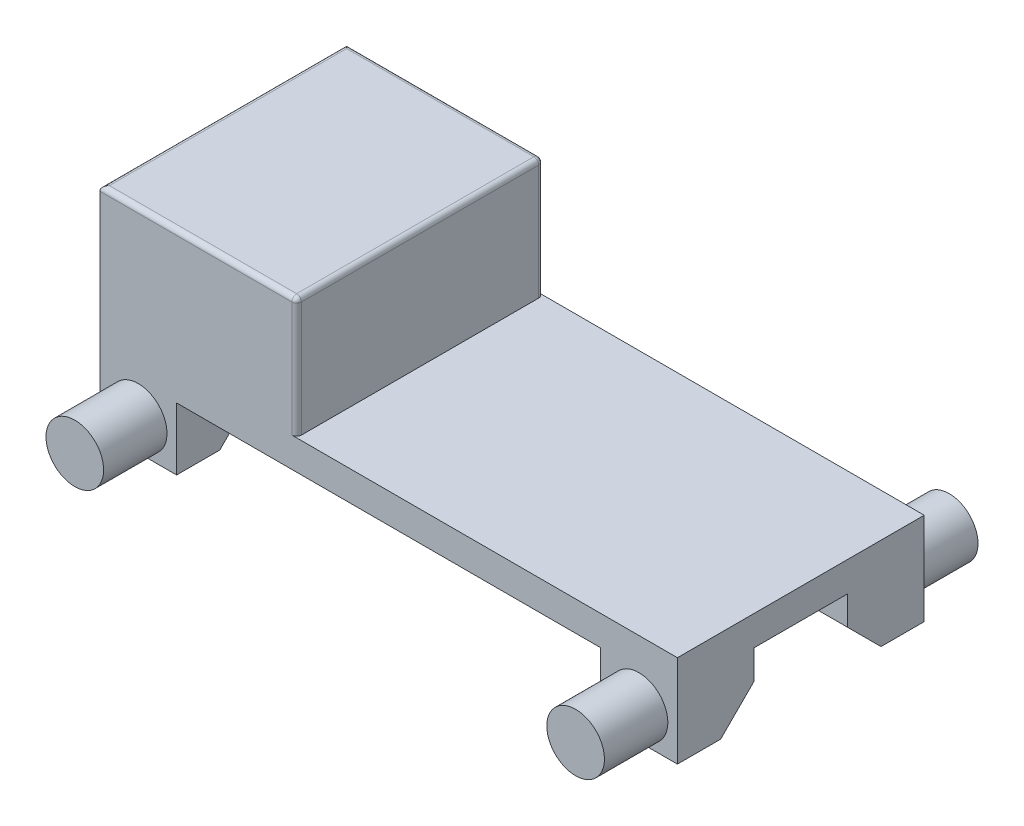
ISO-10303-21;
HEADER;
FILE_DESCRIPTION(('STEP AP214'),'2;1');
FILE_NAME('part.step','',(''),(''),'','','');
FILE_SCHEMA(('AUTOMOTIVE_DESIGN { 1 0 10303 214 1 1 1 1 }'));
ENDSEC;
DATA;
#1=APPLICATION_CONTEXT('core data for automotive mechanical design processes');
#2=APPLICATION_PROTOCOL_DEFINITION('international standard','automotive_design',2000,#1);
#3=PRODUCT_CONTEXT('',#1,'mechanical');
#4=PRODUCT('Part','Part','',(#3));
#5=PRODUCT_RELATED_PRODUCT_CATEGORY('part','',(#4));
#6=PRODUCT_DEFINITION_FORMATION('','',#4);
#7=PRODUCT_DEFINITION_CONTEXT('part definition',#1,'design');
#8=PRODUCT_DEFINITION('design','',#6,#7);
#9=PRODUCT_DEFINITION_SHAPE('','',#8);
#10=(LENGTH_UNIT() NAMED_UNIT(*) SI_UNIT(.MILLI.,.METRE.));
#11=(NAMED_UNIT(*) PLANE_ANGLE_UNIT() SI_UNIT($,.RADIAN.));
#12=(NAMED_UNIT(*) SI_UNIT($,.STERADIAN.) SOLID_ANGLE_UNIT());
#13=UNCERTAINTY_MEASURE_WITH_UNIT(LENGTH_MEASURE(1.E-05),#10,'distance_accuracy_value','');
#14=(GEOMETRIC_REPRESENTATION_CONTEXT(3) GLOBAL_UNCERTAINTY_ASSIGNED_CONTEXT((#13)) GLOBAL_UNIT_ASSIGNED_CONTEXT((#10,
#11,#12)) REPRESENTATION_CONTEXT('',''));
#15=CARTESIAN_POINT('',(0.,0.,0.));
#16=DIRECTION('',(0.,0.,1.));
#17=DIRECTION('',(1.,0.,0.));
#18=AXIS2_PLACEMENT_3D('',#15,#16,#17);
#19=CARTESIAN_POINT('',(0.,0.,0.));
#20=DIRECTION('',(0.,-1.,0.));
#21=DIRECTION('',(0.,0.,-1.));
#22=AXIS2_PLACEMENT_3D('',#19,#20,#21);
#23=PLANE('',#22);
#24=DIRECTION('',(1.,0.,0.));
#25=VECTOR('',#24,1.);
#26=CARTESIAN_POINT('',(601.5,0.,97.0000000000001));
#27=LINE('',#26,#25);
#28=CARTESIAN_POINT('',(441.5,0.,97.0000000000001));
#29=VERTEX_POINT('',#28);
#30=CARTESIAN_POINT('',(601.5,0.,97.0000000000001));
#31=VERTEX_POINT('',#30);
#32=EDGE_CURVE('E225',#29,#31,#27,.T.);
#33=ORIENTED_EDGE('',*,*,#32,.F.);
#34=DIRECTION('',(0.,0.,-1.));
#35=VECTOR('',#34,1.);
#36=CARTESIAN_POINT('',(441.5,0.,257.));
#37=LINE('',#36,#35);
#38=CARTESIAN_POINT('',(441.5,0.,257.));
#39=VERTEX_POINT('',#38);
#40=EDGE_CURVE('E248',#39,#29,#37,.T.);
#41=ORIENTED_EDGE('',*,*,#40,.F.);
#42=DIRECTION('',(1.,0.,0.));
#43=VECTOR('',#42,1.);
#44=CARTESIAN_POINT('',(-601.5,0.,257.));
#45=LINE('',#44,#43);
#46=CARTESIAN_POINT('',(-441.5,0.,257.));
#47=VERTEX_POINT('',#46);
#48=EDGE_CURVE('E327',#47,#39,#45,.T.);
#49=ORIENTED_EDGE('',*,*,#48,.F.);
#50=DIRECTION('',(0.,0.,1.));
#51=VECTOR('',#50,1.);
#52=CARTESIAN_POINT('',(-441.5,0.,257.));
#53=LINE('',#52,#51);
#54=CARTESIAN_POINT('',(-441.5,0.,97.0000000000001));
#55=VERTEX_POINT('',#54);
#56=EDGE_CURVE('E303',#55,#47,#53,.T.);
#57=ORIENTED_EDGE('',*,*,#56,.F.);
#58=DIRECTION('',(1.,0.,0.));
#59=VECTOR('',#58,1.);
#60=CARTESIAN_POINT('',(-601.5,0.,97.0000000000001));
#61=LINE('',#60,#59);
#62=CARTESIAN_POINT('',(-601.5,0.,97.0000000000001));
#63=VERTEX_POINT('',#62);
#64=EDGE_CURVE('E298',#63,#55,#61,.T.);
#65=ORIENTED_EDGE('',*,*,#64,.F.);
#66=DIRECTION('',(0.,0.,1.));
#67=VECTOR('',#66,1.);
#68=CARTESIAN_POINT('',(-601.5,0.,257.));
#69=LINE('',#68,#67);
#70=CARTESIAN_POINT('',(-601.5,0.,-97.0000000000001));
#71=VERTEX_POINT('',#70);
#72=EDGE_CURVE('E334',#71,#63,#69,.T.);
#73=ORIENTED_EDGE('',*,*,#72,.F.);
#74=DIRECTION('',(-1.,0.,0.));
#75=VECTOR('',#74,1.);
#76=CARTESIAN_POINT('',(-601.5,0.,-97.0000000000001));
#77=LINE('',#76,#75);
#78=CARTESIAN_POINT('',(-441.5,0.,-97.0000000000001));
#79=VERTEX_POINT('',#78);
#80=EDGE_CURVE('E282',#79,#71,#77,.T.);
#81=ORIENTED_EDGE('',*,*,#80,.F.);
#82=DIRECTION('',(0.,0.,1.));
#83=VECTOR('',#82,1.);
#84=CARTESIAN_POINT('',(-441.5,0.,-257.));
#85=LINE('',#84,#83);
#86=CARTESIAN_POINT('',(-441.5,0.,-257.));
#87=VERTEX_POINT('',#86);
#88=EDGE_CURVE('E278',#87,#79,#85,.T.);
#89=ORIENTED_EDGE('',*,*,#88,.F.);
#90=DIRECTION('',(-1.,0.,0.));
#91=VECTOR('',#90,1.);
#92=CARTESIAN_POINT('',(-601.5,0.,-257.));
#93=LINE('',#92,#91);
#94=CARTESIAN_POINT('',(441.5,0.,-257.));
#95=VERTEX_POINT('',#94);
#96=EDGE_CURVE('E332',#95,#87,#93,.T.);
#97=ORIENTED_EDGE('',*,*,#96,.F.);
#98=DIRECTION('',(0.,0.,-1.));
#99=VECTOR('',#98,1.);
#100=CARTESIAN_POINT('',(441.5,0.,-257.));
#101=LINE('',#100,#99);
#102=CARTESIAN_POINT('',(441.5,0.,-97.0000000000001));
#103=VERTEX_POINT('',#102);
#104=EDGE_CURVE('E263',#103,#95,#101,.T.);
#105=ORIENTED_EDGE('',*,*,#104,.F.);
#106=DIRECTION('',(-1.,0.,0.));
#107=VECTOR('',#106,1.);
#108=CARTESIAN_POINT('',(601.5,0.,-97.0000000000001));
#109=LINE('',#108,#107);
#110=CARTESIAN_POINT('',(601.5,0.,-97.0000000000001));
#111=VERTEX_POINT('',#110);
#112=EDGE_CURVE('E258',#111,#103,#109,.T.);
#113=ORIENTED_EDGE('',*,*,#112,.F.);
#114=DIRECTION('',(0.,0.,-1.));
#115=VECTOR('',#114,1.);
#116=CARTESIAN_POINT('',(601.5,0.,257.));
#117=LINE('',#116,#115);
#118=EDGE_CURVE('E323',#31,#111,#117,.T.);
#119=ORIENTED_EDGE('',*,*,#118,.F.);
#120=EDGE_LOOP('',(#33,#41,#49,#57,#65,#73,#81,#89,#97,#105,#113,#119));
#121=FACE_BOUND('',#120,.T.);
#122=ADVANCED_FACE('F40',(#121),#23,.T.);
#123=CARTESIAN_POINT('',(0.,62.,0.));
#124=DIRECTION('',(0.,-1.,0.));
#125=DIRECTION('',(0.,0.,-1.));
#126=AXIS2_PLACEMENT_3D('',#123,#124,#125);
#127=PLANE('',#126);
#128=DIRECTION('',(0.,0.,-1.));
#129=VECTOR('',#128,1.);
#130=CARTESIAN_POINT('',(-191.5,62.,-257.));
#131=LINE('',#130,#129);
#132=CARTESIAN_POINT('',(-191.5,62.,247.));
#133=VERTEX_POINT('',#132);
#134=CARTESIAN_POINT('',(-191.5,62.,-247.));
#135=VERTEX_POINT('',#134);
#136=EDGE_CURVE('E320',#133,#135,#131,.T.);
#137=ORIENTED_EDGE('',*,*,#136,.F.);
#138=CARTESIAN_POINT('',(-201.5,62.,247.));
#139=DIRECTION('',(0.,-1.,0.));
#140=DIRECTION('',(0.,0.,-1.));
#141=AXIS2_PLACEMENT_3D('',#138,#139,#140);
#142=CIRCLE('',#141,10.);
#143=CARTESIAN_POINT('',(-201.5,62.,257.));
#144=VERTEX_POINT('',#143);
#145=EDGE_CURVE('E372',#133,#144,#142,.T.);
#146=ORIENTED_EDGE('',*,*,#145,.T.);
#147=DIRECTION('',(1.,0.,0.));
#148=VECTOR('',#147,1.);
#149=CARTESIAN_POINT('',(-601.5,62.,257.));
#150=LINE('',#149,#148);
#151=CARTESIAN_POINT('',(601.5,62.,257.));
#152=VERTEX_POINT('',#151);
#153=EDGE_CURVE('E237',#144,#152,#150,.T.);
#154=ORIENTED_EDGE('',*,*,#153,.T.);
#155=DIRECTION('',(0.,0.,-1.));
#156=VECTOR('',#155,1.);
#157=CARTESIAN_POINT('',(601.5,62.,257.));
#158=LINE('',#157,#156);
#159=CARTESIAN_POINT('',(601.5,62.,-257.));
#160=VERTEX_POINT('',#159);
#161=EDGE_CURVE('E234',#152,#160,#158,.T.);
#162=ORIENTED_EDGE('',*,*,#161,.T.);
#163=DIRECTION('',(-1.,0.,0.));
#164=VECTOR('',#163,1.);
#165=CARTESIAN_POINT('',(-601.5,62.,-257.));
#166=LINE('',#165,#164);
#167=CARTESIAN_POINT('',(-201.5,62.,-257.));
#168=VERTEX_POINT('',#167);
#169=EDGE_CURVE('E326',#160,#168,#166,.T.);
#170=ORIENTED_EDGE('',*,*,#169,.T.);
#171=CARTESIAN_POINT('',(-201.5,62.,-247.));
#172=DIRECTION('',(0.,-1.,0.));
#173=DIRECTION('',(0.,0.,-1.));
#174=AXIS2_PLACEMENT_3D('',#171,#172,#173);
#175=CIRCLE('',#174,10.);
#176=EDGE_CURVE('E370',#168,#135,#175,.T.);
#177=ORIENTED_EDGE('',*,*,#176,.T.);
#178=EDGE_LOOP('',(#137,#146,#154,#162,#170,#177));
#179=FACE_BOUND('',#178,.T.);
#180=ADVANCED_FACE('F452',(#179),#127,.F.);
#181=CARTESIAN_POINT('',(601.5,62.,257.));
#182=DIRECTION('',(-1.,0.,0.));
#183=DIRECTION('',(0.,0.,1.));
#184=AXIS2_PLACEMENT_3D('',#181,#182,#183);
#185=PLANE('',#184);
#186=DIRECTION('',(0.,1.,0.));
#187=VECTOR('',#186,1.);
#188=CARTESIAN_POINT('',(601.5,-130.,-97.0000000000001));
#189=LINE('',#188,#187);
#190=CARTESIAN_POINT('',(601.5,-59.9999999999996,-97.0000000000001));
#191=VERTEX_POINT('',#190);
#192=EDGE_CURVE('E276',#191,#111,#189,.T.);
#193=ORIENTED_EDGE('',*,*,#192,.F.);
#194=DIRECTION('',(0.,0.707106781186549,0.707106781186546));
#195=VECTOR('',#194,1.);
#196=CARTESIAN_POINT('',(601.5,-130.,-167.));
#197=LINE('',#196,#195);
#198=CARTESIAN_POINT('',(601.5,-130.,-167.));
#199=VERTEX_POINT('',#198);
#200=EDGE_CURVE('E423',#191,#199,#197,.F.);
#201=ORIENTED_EDGE('',*,*,#200,.T.);
#202=DIRECTION('',(0.,0.,1.));
#203=VECTOR('',#202,1.);
#204=CARTESIAN_POINT('',(601.5,-130.,-257.));
#205=LINE('',#204,#203);
#206=CARTESIAN_POINT('',(601.5,-130.,-257.));
#207=VERTEX_POINT('',#206);
#208=EDGE_CURVE('E262',#207,#199,#205,.T.);
#209=ORIENTED_EDGE('',*,*,#208,.F.);
#210=DIRECTION('',(0.,-1.,0.));
#211=VECTOR('',#210,1.);
#212=CARTESIAN_POINT('',(601.5,62.,-257.));
#213=LINE('',#212,#211);
#214=EDGE_CURVE('E342',#160,#207,#213,.T.);
#215=ORIENTED_EDGE('',*,*,#214,.F.);
#216=ORIENTED_EDGE('',*,*,#161,.F.);
#217=DIRECTION('',(0.,-1.,0.));
#218=VECTOR('',#217,1.);
#219=CARTESIAN_POINT('',(601.5,62.,257.));
#220=LINE('',#219,#218);
#221=CARTESIAN_POINT('',(601.5,-130.,257.));
#222=VERTEX_POINT('',#221);
#223=EDGE_CURVE('E229',#152,#222,#220,.T.);
#224=ORIENTED_EDGE('',*,*,#223,.T.);
#225=DIRECTION('',(0.,0.,1.));
#226=VECTOR('',#225,1.);
#227=CARTESIAN_POINT('',(601.5,-130.,257.));
#228=LINE('',#227,#226);
#229=CARTESIAN_POINT('',(601.5,-130.,167.));
#230=VERTEX_POINT('',#229);
#231=EDGE_CURVE('E216',#230,#222,#228,.T.);
#232=ORIENTED_EDGE('',*,*,#231,.F.);
#233=DIRECTION('',(0.,-0.707106781186549,0.707106781186546));
#234=VECTOR('',#233,1.);
#235=CARTESIAN_POINT('',(601.5,-130.,167.));
#236=LINE('',#235,#234);
#237=CARTESIAN_POINT('',(601.5,-59.9999999999996,97.0000000000001));
#238=VERTEX_POINT('',#237);
#239=EDGE_CURVE('E421',#230,#238,#236,.F.);
#240=ORIENTED_EDGE('',*,*,#239,.T.);
#241=DIRECTION('',(0.,1.,0.));
#242=VECTOR('',#241,1.);
#243=CARTESIAN_POINT('',(601.5,-130.,97.0000000000001));
#244=LINE('',#243,#242);
#245=EDGE_CURVE('E244',#238,#31,#244,.T.);
#246=ORIENTED_EDGE('',*,*,#245,.T.);
#247=ORIENTED_EDGE('',*,*,#118,.T.);
#248=EDGE_LOOP('',(#193,#201,#209,#215,#216,#224,#232,#240,#246,#247));
#249=FACE_BOUND('',#248,.T.);
#250=ADVANCED_FACE('F231',(#249),#185,.F.);
#251=CARTESIAN_POINT('',(-601.5,62.,-257.));
#252=DIRECTION('',(0.,0.,1.));
#253=DIRECTION('',(1.,0.,0.));
#254=AXIS2_PLACEMENT_3D('',#251,#252,#253);
#255=PLANE('',#254);
#256=CARTESIAN_POINT('',(-521.5,-65.,-257.));
#257=DIRECTION('',(0.,0.,1.));
#258=DIRECTION('',(1.,0.,0.));
#259=AXIS2_PLACEMENT_3D('',#256,#257,#258);
#260=CIRCLE('',#259,60.);
#261=CARTESIAN_POINT('',(-461.5,-65.,-257.));
#262=VERTEX_POINT('',#261);
#263=EDGE_CURVE('E49',#262,#262,#260,.F.);
#264=ORIENTED_EDGE('',*,*,#263,.F.);
#265=EDGE_LOOP('',(#264));
#266=FACE_BOUND('',#265,.T.);
#267=CARTESIAN_POINT('',(521.5,-65.,-257.));
#268=DIRECTION('',(0.,0.,1.));
#269=DIRECTION('',(1.,0.,0.));
#270=AXIS2_PLACEMENT_3D('',#267,#268,#269);
#271=CIRCLE('',#270,60.);
#272=CARTESIAN_POINT('',(581.5,-65.,-257.));
#273=VERTEX_POINT('',#272);
#274=EDGE_CURVE('E440',#273,#273,#271,.T.);
#275=ORIENTED_EDGE('',*,*,#274,.T.);
#276=EDGE_LOOP('',(#275));
#277=FACE_BOUND('',#276,.T.);
#278=DIRECTION('',(0.,-1.,0.));
#279=VECTOR('',#278,1.);
#280=CARTESIAN_POINT('',(-201.5,62.,-257.));
#281=LINE('',#280,#279);
#282=CARTESIAN_POINT('',(-201.5,302.,-257.));
#283=VERTEX_POINT('',#282);
#284=EDGE_CURVE('E346',#283,#168,#281,.T.);
#285=ORIENTED_EDGE('',*,*,#284,.T.);
#286=ORIENTED_EDGE('',*,*,#169,.F.);
#287=ORIENTED_EDGE('',*,*,#214,.T.);
#288=DIRECTION('',(1.,0.,0.));
#289=VECTOR('',#288,1.);
#290=CARTESIAN_POINT('',(601.5,-130.,-257.));
#291=LINE('',#290,#289);
#292=CARTESIAN_POINT('',(441.5,-130.,-257.));
#293=VERTEX_POINT('',#292);
#294=EDGE_CURVE('E259',#293,#207,#291,.T.);
#295=ORIENTED_EDGE('',*,*,#294,.F.);
#296=DIRECTION('',(0.,1.,0.));
#297=VECTOR('',#296,1.);
#298=CARTESIAN_POINT('',(441.5,-130.,-257.));
#299=LINE('',#298,#297);
#300=EDGE_CURVE('E268',#293,#95,#299,.T.);
#301=ORIENTED_EDGE('',*,*,#300,.T.);
#302=ORIENTED_EDGE('',*,*,#96,.T.);
#303=DIRECTION('',(0.,1.,0.));
#304=VECTOR('',#303,1.);
#305=CARTESIAN_POINT('',(-441.5,-130.,-257.));
#306=LINE('',#305,#304);
#307=CARTESIAN_POINT('',(-441.5,-130.,-257.));
#308=VERTEX_POINT('',#307);
#309=EDGE_CURVE('E295',#308,#87,#306,.T.);
#310=ORIENTED_EDGE('',*,*,#309,.F.);
#311=DIRECTION('',(1.,0.,0.));
#312=VECTOR('',#311,1.);
#313=CARTESIAN_POINT('',(-601.5,-130.,-257.));
#314=LINE('',#313,#312);
#315=CARTESIAN_POINT('',(-601.5,-130.,-257.));
#316=VERTEX_POINT('',#315);
#317=EDGE_CURVE('E281',#316,#308,#314,.T.);
#318=ORIENTED_EDGE('',*,*,#317,.F.);
#319=DIRECTION('',(0.,-1.,0.));
#320=VECTOR('',#319,1.);
#321=CARTESIAN_POINT('',(-601.5,62.,-257.));
#322=LINE('',#321,#320);
#323=CARTESIAN_POINT('',(-601.5,302.,-257.));
#324=VERTEX_POINT('',#323);
#325=EDGE_CURVE('E339',#324,#316,#322,.T.);
#326=ORIENTED_EDGE('',*,*,#325,.F.);
#327=DIRECTION('',(-1.,0.,0.));
#328=VECTOR('',#327,1.);
#329=CARTESIAN_POINT('',(-191.5,302.,-257.));
#330=LINE('',#329,#328);
#331=EDGE_CURVE('E344',#324,#283,#330,.F.);
#332=ORIENTED_EDGE('',*,*,#331,.T.);
#333=EDGE_LOOP('',(#285,#286,#287,#295,#301,#302,#310,#318,#326,#332));
#334=FACE_BOUND('',#333,.T.);
#335=ADVANCED_FACE('F432',(#266,#277,#334),#255,.F.);
#336=CARTESIAN_POINT('',(-601.5,62.,257.));
#337=DIRECTION('',(1.,0.,0.));
#338=DIRECTION('',(0.,0.,-1.));
#339=AXIS2_PLACEMENT_3D('',#336,#337,#338);
#340=PLANE('',#339);
#341=DIRECTION('',(0.,1.,0.));
#342=VECTOR('',#341,1.);
#343=CARTESIAN_POINT('',(-601.5,-130.,97.0000000000001));
#344=LINE('',#343,#342);
#345=CARTESIAN_POINT('',(-601.5,-59.9999999999996,97.0000000000001));
#346=VERTEX_POINT('',#345);
#347=EDGE_CURVE('E317',#346,#63,#344,.T.);
#348=ORIENTED_EDGE('',*,*,#347,.F.);
#349=DIRECTION('',(0.,-0.707106781186549,0.707106781186546));
#350=VECTOR('',#349,1.);
#351=CARTESIAN_POINT('',(-601.5,-130.,167.));
#352=LINE('',#351,#350);
#353=CARTESIAN_POINT('',(-601.5,-130.,167.));
#354=VERTEX_POINT('',#353);
#355=EDGE_CURVE('E405',#346,#354,#352,.T.);
#356=ORIENTED_EDGE('',*,*,#355,.T.);
#357=DIRECTION('',(0.,0.,-1.));
#358=VECTOR('',#357,1.);
#359=CARTESIAN_POINT('',(-601.5,-130.,257.));
#360=LINE('',#359,#358);
#361=CARTESIAN_POINT('',(-601.5,-130.,257.));
#362=VERTEX_POINT('',#361);
#363=EDGE_CURVE('E299',#362,#354,#360,.T.);
#364=ORIENTED_EDGE('',*,*,#363,.F.);
#365=DIRECTION('',(0.,-1.,0.));
#366=VECTOR('',#365,1.);
#367=CARTESIAN_POINT('',(-601.5,62.,257.));
#368=LINE('',#367,#366);
#369=CARTESIAN_POINT('',(-601.5,302.,257.));
#370=VERTEX_POINT('',#369);
#371=EDGE_CURVE('E236',#370,#362,#368,.T.);
#372=ORIENTED_EDGE('',*,*,#371,.F.);
#373=DIRECTION('',(0.,0.,1.));
#374=VECTOR('',#373,1.);
#375=CARTESIAN_POINT('',(-601.5,302.,-257.));
#376=LINE('',#375,#374);
#377=EDGE_CURVE('E368',#370,#324,#376,.F.);
#378=ORIENTED_EDGE('',*,*,#377,.T.);
#379=ORIENTED_EDGE('',*,*,#325,.T.);
#380=DIRECTION('',(0.,0.,-1.));
#381=VECTOR('',#380,1.);
#382=CARTESIAN_POINT('',(-601.5,-130.,-257.));
#383=LINE('',#382,#381);
#384=CARTESIAN_POINT('',(-601.5,-130.,-167.));
#385=VERTEX_POINT('',#384);
#386=EDGE_CURVE('E279',#385,#316,#383,.T.);
#387=ORIENTED_EDGE('',*,*,#386,.F.);
#388=DIRECTION('',(0.,-0.707106781186549,-0.707106781186546));
#389=VECTOR('',#388,1.);
#390=CARTESIAN_POINT('',(-601.5,-130.,-167.));
#391=LINE('',#390,#389);
#392=CARTESIAN_POINT('',(-601.5,-59.9999999999996,-97.0000000000001));
#393=VERTEX_POINT('',#392);
#394=EDGE_CURVE('E403',#385,#393,#391,.F.);
#395=ORIENTED_EDGE('',*,*,#394,.T.);
#396=DIRECTION('',(0.,1.,0.));
#397=VECTOR('',#396,1.);
#398=CARTESIAN_POINT('',(-601.5,-130.,-97.0000000000001));
#399=LINE('',#398,#397);
#400=EDGE_CURVE('E287',#393,#71,#399,.T.);
#401=ORIENTED_EDGE('',*,*,#400,.T.);
#402=ORIENTED_EDGE('',*,*,#72,.T.);
#403=EDGE_LOOP('',(#348,#356,#364,#372,#378,#379,#387,#395,#401,#402));
#404=FACE_BOUND('',#403,.T.);
#405=ADVANCED_FACE('F435',(#404),#340,.F.);
#406=CARTESIAN_POINT('',(-601.5,62.,257.));
#407=DIRECTION('',(0.,0.,-1.));
#408=DIRECTION('',(-1.,0.,0.));
#409=AXIS2_PLACEMENT_3D('',#406,#407,#408);
#410=PLANE('',#409);
#411=CARTESIAN_POINT('',(521.5,-65.,257.));
#412=DIRECTION('',(0.,0.,-1.));
#413=DIRECTION('',(-1.,0.,0.));
#414=AXIS2_PLACEMENT_3D('',#411,#412,#413);
#415=CIRCLE('',#414,60.);
#416=CARTESIAN_POINT('',(461.5,-65.,257.));
#417=VERTEX_POINT('',#416);
#418=EDGE_CURVE('E899',#417,#417,#415,.T.);
#419=ORIENTED_EDGE('',*,*,#418,.T.);
#420=EDGE_LOOP('',(#419));
#421=FACE_BOUND('',#420,.T.);
#422=CARTESIAN_POINT('',(-521.5,-65.,257.));
#423=DIRECTION('',(0.,0.,-1.));
#424=DIRECTION('',(-1.,0.,0.));
#425=AXIS2_PLACEMENT_3D('',#422,#423,#424);
#426=CIRCLE('',#425,60.);
#427=CARTESIAN_POINT('',(-581.5,-65.,257.));
#428=VERTEX_POINT('',#427);
#429=EDGE_CURVE('E11',#428,#428,#426,.F.);
#430=ORIENTED_EDGE('',*,*,#429,.F.);
#431=EDGE_LOOP('',(#430));
#432=FACE_BOUND('',#431,.T.);
#433=ORIENTED_EDGE('',*,*,#153,.F.);
#434=DIRECTION('',(0.,-1.,0.));
#435=VECTOR('',#434,1.);
#436=CARTESIAN_POINT('',(-201.5,62.,257.));
#437=LINE('',#436,#435);
#438=CARTESIAN_POINT('',(-201.5,302.,257.));
#439=VERTEX_POINT('',#438);
#440=EDGE_CURVE('E357',#144,#439,#437,.F.);
#441=ORIENTED_EDGE('',*,*,#440,.T.);
#442=DIRECTION('',(1.,0.,0.));
#443=VECTOR('',#442,1.);
#444=CARTESIAN_POINT('',(-601.5,302.,257.));
#445=LINE('',#444,#443);
#446=EDGE_CURVE('E355',#439,#370,#445,.F.);
#447=ORIENTED_EDGE('',*,*,#446,.T.);
#448=ORIENTED_EDGE('',*,*,#371,.T.);
#449=DIRECTION('',(-1.,0.,0.));
#450=VECTOR('',#449,1.);
#451=CARTESIAN_POINT('',(-601.5,-130.,257.));
#452=LINE('',#451,#450);
#453=CARTESIAN_POINT('',(-441.5,-130.,257.));
#454=VERTEX_POINT('',#453);
#455=EDGE_CURVE('E305',#454,#362,#452,.T.);
#456=ORIENTED_EDGE('',*,*,#455,.F.);
#457=DIRECTION('',(0.,1.,0.));
#458=VECTOR('',#457,1.);
#459=CARTESIAN_POINT('',(-441.5,-130.,257.));
#460=LINE('',#459,#458);
#461=EDGE_CURVE('E308',#454,#47,#460,.T.);
#462=ORIENTED_EDGE('',*,*,#461,.T.);
#463=ORIENTED_EDGE('',*,*,#48,.T.);
#464=DIRECTION('',(0.,1.,0.));
#465=VECTOR('',#464,1.);
#466=CARTESIAN_POINT('',(441.5,-130.,257.));
#467=LINE('',#466,#465);
#468=CARTESIAN_POINT('',(441.5,-130.,257.));
#469=VERTEX_POINT('',#468);
#470=EDGE_CURVE('E241',#469,#39,#467,.T.);
#471=ORIENTED_EDGE('',*,*,#470,.F.);
#472=DIRECTION('',(-1.,0.,0.));
#473=VECTOR('',#472,1.);
#474=CARTESIAN_POINT('',(601.5,-130.,257.));
#475=LINE('',#474,#473);
#476=EDGE_CURVE('E220',#222,#469,#475,.T.);
#477=ORIENTED_EDGE('',*,*,#476,.F.);
#478=ORIENTED_EDGE('',*,*,#223,.F.);
#479=EDGE_LOOP('',(#433,#441,#447,#448,#456,#462,#463,#471,#477,#478));
#480=FACE_BOUND('',#479,.T.);
#481=ADVANCED_FACE('F239',(#421,#432,#480),#410,.F.);
#482=CARTESIAN_POINT('',(-191.5,312.,-257.));
#483=DIRECTION('',(-1.,0.,0.));
#484=DIRECTION('',(0.,0.,1.));
#485=AXIS2_PLACEMENT_3D('',#482,#483,#484);
#486=PLANE('',#485);
#487=ORIENTED_EDGE('',*,*,#136,.T.);
#488=DIRECTION('',(0.,-1.,0.));
#489=VECTOR('',#488,1.);
#490=CARTESIAN_POINT('',(-191.5,312.,-247.));
#491=LINE('',#490,#489);
#492=CARTESIAN_POINT('',(-191.5,302.,-247.));
#493=VERTEX_POINT('',#492);
#494=EDGE_CURVE('E353',#135,#493,#491,.F.);
#495=ORIENTED_EDGE('',*,*,#494,.T.);
#496=DIRECTION('',(0.,0.,-1.));
#497=VECTOR('',#496,1.);
#498=CARTESIAN_POINT('',(-191.5,302.,257.));
#499=LINE('',#498,#497);
#500=CARTESIAN_POINT('',(-191.5,302.,247.));
#501=VERTEX_POINT('',#500);
#502=EDGE_CURVE('E349',#493,#501,#499,.F.);
#503=ORIENTED_EDGE('',*,*,#502,.T.);
#504=DIRECTION('',(0.,-1.,0.));
#505=VECTOR('',#504,1.);
#506=CARTESIAN_POINT('',(-191.5,312.,247.));
#507=LINE('',#506,#505);
#508=EDGE_CURVE('E351',#501,#133,#507,.T.);
#509=ORIENTED_EDGE('',*,*,#508,.T.);
#510=EDGE_LOOP('',(#487,#495,#503,#509));
#511=FACE_BOUND('',#510,.T.);
#512=ADVANCED_FACE('F455',(#511),#486,.F.);
#513=CARTESIAN_POINT('',(0.,312.,0.));
#514=DIRECTION('',(0.,1.,0.));
#515=DIRECTION('',(0.,0.,1.));
#516=AXIS2_PLACEMENT_3D('',#513,#514,#515);
#517=PLANE('',#516);
#518=DIRECTION('',(1.,0.,0.));
#519=VECTOR('',#518,1.);
#520=CARTESIAN_POINT('',(-191.5,312.,247.));
#521=LINE('',#520,#519);
#522=CARTESIAN_POINT('',(-591.5,312.,247.));
#523=VERTEX_POINT('',#522);
#524=CARTESIAN_POINT('',(-201.5,312.,247.));
#525=VERTEX_POINT('',#524);
#526=EDGE_CURVE('E359',#523,#525,#521,.T.);
#527=ORIENTED_EDGE('',*,*,#526,.T.);
#528=DIRECTION('',(0.,0.,-1.));
#529=VECTOR('',#528,1.);
#530=CARTESIAN_POINT('',(-201.5,312.,-257.));
#531=LINE('',#530,#529);
#532=CARTESIAN_POINT('',(-201.5,312.,-247.));
#533=VERTEX_POINT('',#532);
#534=EDGE_CURVE('E365',#525,#533,#531,.T.);
#535=ORIENTED_EDGE('',*,*,#534,.T.);
#536=DIRECTION('',(-1.,0.,0.));
#537=VECTOR('',#536,1.);
#538=CARTESIAN_POINT('',(-601.5,312.,-247.));
#539=LINE('',#538,#537);
#540=CARTESIAN_POINT('',(-591.5,312.,-247.));
#541=VERTEX_POINT('',#540);
#542=EDGE_CURVE('E363',#533,#541,#539,.T.);
#543=ORIENTED_EDGE('',*,*,#542,.T.);
#544=DIRECTION('',(0.,0.,1.));
#545=VECTOR('',#544,1.);
#546=CARTESIAN_POINT('',(-591.5,312.,257.));
#547=LINE('',#546,#545);
#548=EDGE_CURVE('E361',#541,#523,#547,.T.);
#549=ORIENTED_EDGE('',*,*,#548,.T.);
#550=EDGE_LOOP('',(#527,#535,#543,#549));
#551=FACE_BOUND('',#550,.T.);
#552=ADVANCED_FACE('F472',(#551),#517,.T.);
#553=CARTESIAN_POINT('',(-201.5,312.,247.));
#554=DIRECTION('',(0.,-1.,0.));
#555=DIRECTION('',(0.,0.,-1.));
#556=AXIS2_PLACEMENT_3D('',#553,#554,#555);
#557=CYLINDRICAL_SURFACE('',#556,10.);
#558=ORIENTED_EDGE('',*,*,#145,.F.);
#559=ORIENTED_EDGE('',*,*,#508,.F.);
#560=CARTESIAN_POINT('',(-201.5,302.,247.));
#561=DIRECTION('',(0.,1.,0.));
#562=DIRECTION('',(0.,0.,1.));
#563=AXIS2_PLACEMENT_3D('',#560,#561,#562);
#564=CIRCLE('',#563,10.);
#565=EDGE_CURVE('E324',#439,#501,#564,.T.);
#566=ORIENTED_EDGE('',*,*,#565,.F.);
#567=ORIENTED_EDGE('',*,*,#440,.F.);
#568=EDGE_LOOP('',(#558,#559,#566,#567));
#569=FACE_BOUND('',#568,.T.);
#570=ADVANCED_FACE('F460',(#569),#557,.T.);
#571=CARTESIAN_POINT('',(0.,302.,247.));
#572=DIRECTION('',(-1.,0.,0.));
#573=DIRECTION('',(0.,0.,1.));
#574=AXIS2_PLACEMENT_3D('',#571,#572,#573);
#575=CYLINDRICAL_SURFACE('',#574,10.);
#576=CARTESIAN_POINT('',(-591.5,302.,247.));
#577=DIRECTION('',(-0.707106781186547,0.,-0.707106781186547));
#578=DIRECTION('',(-0.707106781186547,0.,0.707106781186547));
#579=AXIS2_PLACEMENT_3D('',#576,#577,#578);
#580=ELLIPSE('',#579,14.1421356237309,10.);
#581=EDGE_CURVE('E389',#370,#523,#580,.T.);
#582=ORIENTED_EDGE('',*,*,#581,.F.);
#583=ORIENTED_EDGE('',*,*,#446,.F.);
#584=CARTESIAN_POINT('',(-201.5,302.,247.));
#585=DIRECTION('',(1.,0.,0.));
#586=DIRECTION('',(0.,0.,-1.));
#587=AXIS2_PLACEMENT_3D('',#584,#585,#586);
#588=CIRCLE('',#587,10.);
#589=EDGE_CURVE('E392',#525,#439,#588,.T.);
#590=ORIENTED_EDGE('',*,*,#589,.F.);
#591=ORIENTED_EDGE('',*,*,#526,.F.);
#592=EDGE_LOOP('',(#582,#583,#590,#591));
#593=FACE_BOUND('',#592,.T.);
#594=ADVANCED_FACE('F478',(#593),#575,.T.);
#595=CARTESIAN_POINT('',(-201.5,302.,247.));
#596=DIRECTION('',(0.,0.,1.));
#597=DIRECTION('',(1.,0.,0.));
#598=AXIS2_PLACEMENT_3D('',#595,#596,#597);
#599=SPHERICAL_SURFACE('',#598,10.);
#600=ORIENTED_EDGE('',*,*,#589,.T.);
#601=ORIENTED_EDGE('',*,*,#565,.T.);
#602=CARTESIAN_POINT('',(-201.5,302.,247.));
#603=DIRECTION('',(0.,0.,1.));
#604=DIRECTION('',(1.,0.,0.));
#605=AXIS2_PLACEMENT_3D('',#602,#603,#604);
#606=CIRCLE('',#605,10.);
#607=EDGE_CURVE('E386',#525,#501,#606,.F.);
#608=ORIENTED_EDGE('',*,*,#607,.F.);
#609=EDGE_LOOP('',(#600,#601,#608));
#610=FACE_BOUND('',#609,.T.);
#611=ADVANCED_FACE('F464',(#610),#599,.T.);
#612=CARTESIAN_POINT('',(-591.5,302.,0.));
#613=DIRECTION('',(0.,0.,-1.));
#614=DIRECTION('',(-1.,0.,0.));
#615=AXIS2_PLACEMENT_3D('',#612,#613,#614);
#616=CYLINDRICAL_SURFACE('',#615,10.);
#617=ORIENTED_EDGE('',*,*,#581,.T.);
#618=ORIENTED_EDGE('',*,*,#548,.F.);
#619=CARTESIAN_POINT('',(-591.5,302.,-247.));
#620=DIRECTION('',(0.707106781186547,0.,-0.707106781186547));
#621=DIRECTION('',(-0.707106781186547,0.,-0.707106781186547));
#622=AXIS2_PLACEMENT_3D('',#619,#620,#621);
#623=ELLIPSE('',#622,14.1421356237309,10.);
#624=EDGE_CURVE('E383',#324,#541,#623,.T.);
#625=ORIENTED_EDGE('',*,*,#624,.F.);
#626=ORIENTED_EDGE('',*,*,#377,.F.);
#627=EDGE_LOOP('',(#617,#618,#625,#626));
#628=FACE_BOUND('',#627,.T.);
#629=ADVANCED_FACE('F548',(#628),#616,.T.);
#630=CARTESIAN_POINT('',(-201.5,302.,0.));
#631=DIRECTION('',(0.,0.,1.));
#632=DIRECTION('',(1.,0.,0.));
#633=AXIS2_PLACEMENT_3D('',#630,#631,#632);
#634=CYLINDRICAL_SURFACE('',#633,10.);
#635=ORIENTED_EDGE('',*,*,#607,.T.);
#636=ORIENTED_EDGE('',*,*,#502,.F.);
#637=CARTESIAN_POINT('',(-201.5,302.,-247.));
#638=DIRECTION('',(0.,0.,-1.));
#639=DIRECTION('',(-1.,0.,0.));
#640=AXIS2_PLACEMENT_3D('',#637,#638,#639);
#641=CIRCLE('',#640,10.);
#642=EDGE_CURVE('E380',#533,#493,#641,.T.);
#643=ORIENTED_EDGE('',*,*,#642,.F.);
#644=ORIENTED_EDGE('',*,*,#534,.F.);
#645=EDGE_LOOP('',(#635,#636,#643,#644));
#646=FACE_BOUND('',#645,.T.);
#647=ADVANCED_FACE('F468',(#646),#634,.T.);
#648=CARTESIAN_POINT('',(0.,302.,-247.));
#649=DIRECTION('',(1.,0.,0.));
#650=DIRECTION('',(0.,0.,-1.));
#651=AXIS2_PLACEMENT_3D('',#648,#649,#650);
#652=CYLINDRICAL_SURFACE('',#651,10.);
#653=ORIENTED_EDGE('',*,*,#624,.T.);
#654=ORIENTED_EDGE('',*,*,#542,.F.);
#655=CARTESIAN_POINT('',(-201.5,302.,-247.));
#656=DIRECTION('',(1.,0.,0.));
#657=DIRECTION('',(0.,0.,-1.));
#658=AXIS2_PLACEMENT_3D('',#655,#656,#657);
#659=CIRCLE('',#658,10.);
#660=EDGE_CURVE('E378',#283,#533,#659,.T.);
#661=ORIENTED_EDGE('',*,*,#660,.F.);
#662=ORIENTED_EDGE('',*,*,#331,.F.);
#663=EDGE_LOOP('',(#653,#654,#661,#662));
#664=FACE_BOUND('',#663,.T.);
#665=ADVANCED_FACE('F550',(#664),#652,.T.);
#666=CARTESIAN_POINT('',(-201.5,302.,-247.));
#667=DIRECTION('',(0.,1.,0.));
#668=DIRECTION('',(0.,0.,1.));
#669=AXIS2_PLACEMENT_3D('',#666,#667,#668);
#670=SPHERICAL_SURFACE('',#669,10.);
#671=ORIENTED_EDGE('',*,*,#660,.T.);
#672=ORIENTED_EDGE('',*,*,#642,.T.);
#673=CARTESIAN_POINT('',(-201.5,302.,-247.));
#674=DIRECTION('',(0.,1.,0.));
#675=DIRECTION('',(0.,0.,1.));
#676=AXIS2_PLACEMENT_3D('',#673,#674,#675);
#677=CIRCLE('',#676,10.);
#678=EDGE_CURVE('E319',#283,#493,#677,.F.);
#679=ORIENTED_EDGE('',*,*,#678,.F.);
#680=EDGE_LOOP('',(#671,#672,#679));
#681=FACE_BOUND('',#680,.T.);
#682=ADVANCED_FACE('F552',(#681),#670,.T.);
#683=CARTESIAN_POINT('',(-201.5,62.,-247.));
#684=DIRECTION('',(0.,-1.,0.));
#685=DIRECTION('',(0.,0.,-1.));
#686=AXIS2_PLACEMENT_3D('',#683,#684,#685);
#687=CYLINDRICAL_SURFACE('',#686,10.);
#688=ORIENTED_EDGE('',*,*,#678,.T.);
#689=ORIENTED_EDGE('',*,*,#494,.F.);
#690=ORIENTED_EDGE('',*,*,#176,.F.);
#691=ORIENTED_EDGE('',*,*,#284,.F.);
#692=EDGE_LOOP('',(#688,#689,#690,#691));
#693=FACE_BOUND('',#692,.T.);
#694=ADVANCED_FACE('F447',(#693),#687,.T.);
#695=CARTESIAN_POINT('',(-601.5,-130.,97.0000000000001));
#696=DIRECTION('',(0.,0.,1.));
#697=DIRECTION('',(1.,0.,0.));
#698=AXIS2_PLACEMENT_3D('',#695,#696,#697);
#699=PLANE('',#698);
#700=DIRECTION('',(0.,1.,0.));
#701=VECTOR('',#700,1.);
#702=CARTESIAN_POINT('',(-441.5,-130.,97.0000000000001));
#703=LINE('',#702,#701);
#704=CARTESIAN_POINT('',(-441.5,-59.9999999999996,97.0000000000001));
#705=VERTEX_POINT('',#704);
#706=EDGE_CURVE('E315',#705,#55,#703,.T.);
#707=ORIENTED_EDGE('',*,*,#706,.F.);
#708=DIRECTION('',(-1.,0.,0.));
#709=VECTOR('',#708,1.);
#710=CARTESIAN_POINT('',(-601.5,-59.9999999999996,97.0000000000001));
#711=LINE('',#710,#709);
#712=EDGE_CURVE('E401',#705,#346,#711,.T.);
#713=ORIENTED_EDGE('',*,*,#712,.T.);
#714=ORIENTED_EDGE('',*,*,#347,.T.);
#715=ORIENTED_EDGE('',*,*,#64,.T.);
#716=EDGE_LOOP('',(#707,#713,#714,#715));
#717=FACE_BOUND('',#716,.T.);
#718=ADVANCED_FACE('F499',(#717),#699,.F.);
#719=CARTESIAN_POINT('',(-441.5,-130.,257.));
#720=DIRECTION('',(-1.,0.,0.));
#721=DIRECTION('',(0.,0.,1.));
#722=AXIS2_PLACEMENT_3D('',#719,#720,#721);
#723=PLANE('',#722);
#724=DIRECTION('',(0.,0.,1.));
#725=VECTOR('',#724,1.);
#726=CARTESIAN_POINT('',(-441.5,-130.,257.));
#727=LINE('',#726,#725);
#728=CARTESIAN_POINT('',(-441.5,-130.,167.));
#729=VERTEX_POINT('',#728);
#730=EDGE_CURVE('E302',#729,#454,#727,.T.);
#731=ORIENTED_EDGE('',*,*,#730,.F.);
#732=DIRECTION('',(0.,0.707106781186549,-0.707106781186546));
#733=VECTOR('',#732,1.);
#734=CARTESIAN_POINT('',(-441.5,-130.,167.));
#735=LINE('',#734,#733);
#736=EDGE_CURVE('E399',#729,#705,#735,.T.);
#737=ORIENTED_EDGE('',*,*,#736,.T.);
#738=ORIENTED_EDGE('',*,*,#706,.T.);
#739=ORIENTED_EDGE('',*,*,#56,.T.);
#740=ORIENTED_EDGE('',*,*,#461,.F.);
#741=EDGE_LOOP('',(#731,#737,#738,#739,#740));
#742=FACE_BOUND('',#741,.T.);
#743=ADVANCED_FACE('F495',(#742),#723,.F.);
#744=CARTESIAN_POINT('',(0.,-130.,0.));
#745=DIRECTION('',(0.,-1.,0.));
#746=DIRECTION('',(0.,0.,-1.));
#747=AXIS2_PLACEMENT_3D('',#744,#745,#746);
#748=PLANE('',#747);
#749=ORIENTED_EDGE('',*,*,#363,.T.);
#750=DIRECTION('',(1.,0.,0.));
#751=VECTOR('',#750,1.);
#752=CARTESIAN_POINT('',(-441.5,-130.,167.));
#753=LINE('',#752,#751);
#754=EDGE_CURVE('E375',#354,#729,#753,.T.);
#755=ORIENTED_EDGE('',*,*,#754,.T.);
#756=ORIENTED_EDGE('',*,*,#730,.T.);
#757=ORIENTED_EDGE('',*,*,#455,.T.);
#758=EDGE_LOOP('',(#749,#755,#756,#757));
#759=FACE_BOUND('',#758,.T.);
#760=ADVANCED_FACE('F488',(#759),#748,.T.);
#761=CARTESIAN_POINT('',(-441.5,-130.,-257.));
#762=DIRECTION('',(-1.,0.,0.));
#763=DIRECTION('',(0.,0.,1.));
#764=AXIS2_PLACEMENT_3D('',#761,#762,#763);
#765=PLANE('',#764);
#766=DIRECTION('',(0.,1.,0.));
#767=VECTOR('',#766,1.);
#768=CARTESIAN_POINT('',(-441.5,-130.,-97.0000000000001));
#769=LINE('',#768,#767);
#770=CARTESIAN_POINT('',(-441.5,-59.9999999999996,-97.0000000000001));
#771=VERTEX_POINT('',#770);
#772=EDGE_CURVE('E293',#771,#79,#769,.T.);
#773=ORIENTED_EDGE('',*,*,#772,.F.);
#774=DIRECTION('',(0.,0.707106781186549,0.707106781186546));
#775=VECTOR('',#774,1.);
#776=CARTESIAN_POINT('',(-441.5,-130.,-167.));
#777=LINE('',#776,#775);
#778=CARTESIAN_POINT('',(-441.5,-130.,-167.));
#779=VERTEX_POINT('',#778);
#780=EDGE_CURVE('E412',#771,#779,#777,.F.);
#781=ORIENTED_EDGE('',*,*,#780,.T.);
#782=DIRECTION('',(0.,0.,1.));
#783=VECTOR('',#782,1.);
#784=CARTESIAN_POINT('',(-441.5,-130.,-257.));
#785=LINE('',#784,#783);
#786=EDGE_CURVE('E284',#308,#779,#785,.T.);
#787=ORIENTED_EDGE('',*,*,#786,.F.);
#788=ORIENTED_EDGE('',*,*,#309,.T.);
#789=ORIENTED_EDGE('',*,*,#88,.T.);
#790=EDGE_LOOP('',(#773,#781,#787,#788,#789));
#791=FACE_BOUND('',#790,.T.);
#792=ADVANCED_FACE('F534',(#791),#765,.F.);
#793=CARTESIAN_POINT('',(-601.5,-130.,-97.0000000000001));
#794=DIRECTION('',(0.,0.,-1.));
#795=DIRECTION('',(-1.,0.,0.));
#796=AXIS2_PLACEMENT_3D('',#793,#794,#795);
#797=PLANE('',#796);
#798=ORIENTED_EDGE('',*,*,#400,.F.);
#799=DIRECTION('',(1.,0.,0.));
#800=VECTOR('',#799,1.);
#801=CARTESIAN_POINT('',(-601.5,-59.9999999999996,-97.0000000000001));
#802=LINE('',#801,#800);
#803=EDGE_CURVE('E410',#393,#771,#802,.T.);
#804=ORIENTED_EDGE('',*,*,#803,.T.);
#805=ORIENTED_EDGE('',*,*,#772,.T.);
#806=ORIENTED_EDGE('',*,*,#80,.T.);
#807=EDGE_LOOP('',(#798,#804,#805,#806));
#808=FACE_BOUND('',#807,.T.);
#809=ADVANCED_FACE('F537',(#808),#797,.F.);
#810=CARTESIAN_POINT('',(0.,-130.,0.));
#811=DIRECTION('',(0.,1.,0.));
#812=DIRECTION('',(0.,0.,1.));
#813=AXIS2_PLACEMENT_3D('',#810,#811,#812);
#814=PLANE('',#813);
#815=ORIENTED_EDGE('',*,*,#786,.T.);
#816=DIRECTION('',(-1.,0.,0.));
#817=VECTOR('',#816,1.);
#818=CARTESIAN_POINT('',(0.,-130.,-167.));
#819=LINE('',#818,#817);
#820=EDGE_CURVE('E407',#779,#385,#819,.T.);
#821=ORIENTED_EDGE('',*,*,#820,.T.);
#822=ORIENTED_EDGE('',*,*,#386,.T.);
#823=ORIENTED_EDGE('',*,*,#317,.T.);
#824=EDGE_LOOP('',(#815,#821,#822,#823));
#825=FACE_BOUND('',#824,.T.);
#826=ADVANCED_FACE('F545',(#825),#814,.F.);
#827=CARTESIAN_POINT('',(601.5,-130.,-97.0000000000001));
#828=DIRECTION('',(0.,0.,-1.));
#829=DIRECTION('',(-1.,0.,0.));
#830=AXIS2_PLACEMENT_3D('',#827,#828,#829);
#831=PLANE('',#830);
#832=DIRECTION('',(0.,1.,0.));
#833=VECTOR('',#832,1.);
#834=CARTESIAN_POINT('',(441.5,-130.,-97.0000000000001));
#835=LINE('',#834,#833);
#836=CARTESIAN_POINT('',(441.5,-59.9999999999996,-97.0000000000001));
#837=VERTEX_POINT('',#836);
#838=EDGE_CURVE('E274',#837,#103,#835,.T.);
#839=ORIENTED_EDGE('',*,*,#838,.F.);
#840=DIRECTION('',(1.,0.,0.));
#841=VECTOR('',#840,1.);
#842=CARTESIAN_POINT('',(601.5,-59.9999999999996,-97.0000000000001));
#843=LINE('',#842,#841);
#844=EDGE_CURVE('E419',#837,#191,#843,.T.);
#845=ORIENTED_EDGE('',*,*,#844,.T.);
#846=ORIENTED_EDGE('',*,*,#192,.T.);
#847=ORIENTED_EDGE('',*,*,#112,.T.);
#848=EDGE_LOOP('',(#839,#845,#846,#847));
#849=FACE_BOUND('',#848,.T.);
#850=ADVANCED_FACE('F735',(#849),#831,.F.);
#851=CARTESIAN_POINT('',(441.5,-130.,-257.));
#852=DIRECTION('',(1.,0.,0.));
#853=DIRECTION('',(0.,0.,-1.));
#854=AXIS2_PLACEMENT_3D('',#851,#852,#853);
#855=PLANE('',#854);
#856=DIRECTION('',(0.,0.,-1.));
#857=VECTOR('',#856,1.);
#858=CARTESIAN_POINT('',(441.5,-130.,-257.));
#859=LINE('',#858,#857);
#860=CARTESIAN_POINT('',(441.5,-130.,-167.));
#861=VERTEX_POINT('',#860);
#862=EDGE_CURVE('E266',#861,#293,#859,.T.);
#863=ORIENTED_EDGE('',*,*,#862,.F.);
#864=DIRECTION('',(0.,-0.707106781186549,-0.707106781186546));
#865=VECTOR('',#864,1.);
#866=CARTESIAN_POINT('',(441.5,-130.,-167.));
#867=LINE('',#866,#865);
#868=EDGE_CURVE('E417',#861,#837,#867,.F.);
#869=ORIENTED_EDGE('',*,*,#868,.T.);
#870=ORIENTED_EDGE('',*,*,#838,.T.);
#871=ORIENTED_EDGE('',*,*,#104,.T.);
#872=ORIENTED_EDGE('',*,*,#300,.F.);
#873=EDGE_LOOP('',(#863,#869,#870,#871,#872));
#874=FACE_BOUND('',#873,.T.);
#875=ADVANCED_FACE('F524',(#874),#855,.F.);
#876=CARTESIAN_POINT('',(0.,-130.,0.));
#877=DIRECTION('',(0.,1.,0.));
#878=DIRECTION('',(0.,0.,1.));
#879=AXIS2_PLACEMENT_3D('',#876,#877,#878);
#880=PLANE('',#879);
#881=ORIENTED_EDGE('',*,*,#208,.T.);
#882=DIRECTION('',(-1.,0.,0.));
#883=VECTOR('',#882,1.);
#884=CARTESIAN_POINT('',(0.,-130.,-167.));
#885=LINE('',#884,#883);
#886=EDGE_CURVE('E414',#199,#861,#885,.T.);
#887=ORIENTED_EDGE('',*,*,#886,.T.);
#888=ORIENTED_EDGE('',*,*,#862,.T.);
#889=ORIENTED_EDGE('',*,*,#294,.T.);
#890=EDGE_LOOP('',(#881,#887,#888,#889));
#891=FACE_BOUND('',#890,.T.);
#892=ADVANCED_FACE('F521',(#891),#880,.F.);
#893=CARTESIAN_POINT('',(441.5,-130.,257.));
#894=DIRECTION('',(1.,0.,0.));
#895=DIRECTION('',(0.,0.,-1.));
#896=AXIS2_PLACEMENT_3D('',#893,#894,#895);
#897=PLANE('',#896);
#898=DIRECTION('',(0.,1.,0.));
#899=VECTOR('',#898,1.);
#900=CARTESIAN_POINT('',(441.5,-130.,97.0000000000001));
#901=LINE('',#900,#899);
#902=CARTESIAN_POINT('',(441.5,-59.9999999999996,97.0000000000001));
#903=VERTEX_POINT('',#902);
#904=EDGE_CURVE('E255',#903,#29,#901,.T.);
#905=ORIENTED_EDGE('',*,*,#904,.F.);
#906=DIRECTION('',(0.,0.707106781186549,-0.707106781186546));
#907=VECTOR('',#906,1.);
#908=CARTESIAN_POINT('',(441.5,-130.,167.));
#909=LINE('',#908,#907);
#910=CARTESIAN_POINT('',(441.5,-130.,167.));
#911=VERTEX_POINT('',#910);
#912=EDGE_CURVE('E63',#903,#911,#909,.F.);
#913=ORIENTED_EDGE('',*,*,#912,.T.);
#914=DIRECTION('',(0.,0.,-1.));
#915=VECTOR('',#914,1.);
#916=CARTESIAN_POINT('',(441.5,-130.,257.));
#917=LINE('',#916,#915);
#918=EDGE_CURVE('E242',#469,#911,#917,.T.);
#919=ORIENTED_EDGE('',*,*,#918,.F.);
#920=ORIENTED_EDGE('',*,*,#470,.T.);
#921=ORIENTED_EDGE('',*,*,#40,.T.);
#922=EDGE_LOOP('',(#905,#913,#919,#920,#921));
#923=FACE_BOUND('',#922,.T.);
#924=ADVANCED_FACE('F507',(#923),#897,.F.);
#925=CARTESIAN_POINT('',(601.5,-130.,97.0000000000001));
#926=DIRECTION('',(0.,0.,1.));
#927=DIRECTION('',(1.,0.,0.));
#928=AXIS2_PLACEMENT_3D('',#925,#926,#927);
#929=PLANE('',#928);
#930=ORIENTED_EDGE('',*,*,#245,.F.);
#931=DIRECTION('',(-1.,0.,0.));
#932=VECTOR('',#931,1.);
#933=CARTESIAN_POINT('',(601.5,-59.9999999999996,97.0000000000001));
#934=LINE('',#933,#932);
#935=EDGE_CURVE('E56',#238,#903,#934,.T.);
#936=ORIENTED_EDGE('',*,*,#935,.T.);
#937=ORIENTED_EDGE('',*,*,#904,.T.);
#938=ORIENTED_EDGE('',*,*,#32,.T.);
#939=EDGE_LOOP('',(#930,#936,#937,#938));
#940=FACE_BOUND('',#939,.T.);
#941=ADVANCED_FACE('F509',(#940),#929,.F.);
#942=CARTESIAN_POINT('',(0.,-130.,0.));
#943=DIRECTION('',(0.,1.,0.));
#944=DIRECTION('',(0.,0.,1.));
#945=AXIS2_PLACEMENT_3D('',#942,#943,#944);
#946=PLANE('',#945);
#947=ORIENTED_EDGE('',*,*,#918,.T.);
#948=DIRECTION('',(1.,0.,0.));
#949=VECTOR('',#948,1.);
#950=CARTESIAN_POINT('',(0.,-130.,167.));
#951=LINE('',#950,#949);
#952=EDGE_CURVE('E223',#911,#230,#951,.T.);
#953=ORIENTED_EDGE('',*,*,#952,.T.);
#954=ORIENTED_EDGE('',*,*,#231,.T.);
#955=ORIENTED_EDGE('',*,*,#476,.T.);
#956=EDGE_LOOP('',(#947,#953,#954,#955));
#957=FACE_BOUND('',#956,.T.);
#958=ADVANCED_FACE('F218',(#957),#946,.F.);
#959=CARTESIAN_POINT('',(0.,-130.,167.));
#960=DIRECTION('',(0.,-0.707106781186546,-0.707106781186549));
#961=DIRECTION('',(-1.,0.,0.));
#962=AXIS2_PLACEMENT_3D('',#959,#960,#961);
#963=PLANE('',#962);
#964=ORIENTED_EDGE('',*,*,#355,.F.);
#965=ORIENTED_EDGE('',*,*,#712,.F.);
#966=ORIENTED_EDGE('',*,*,#736,.F.);
#967=ORIENTED_EDGE('',*,*,#754,.F.);
#968=EDGE_LOOP('',(#964,#965,#966,#967));
#969=FACE_BOUND('',#968,.T.);
#970=ADVANCED_FACE('F491',(#969),#963,.T.);
#971=CARTESIAN_POINT('',(0.,-130.,-167.));
#972=DIRECTION('',(0.,0.707106781186546,-0.707106781186549));
#973=DIRECTION('',(-1.,0.,0.));
#974=AXIS2_PLACEMENT_3D('',#971,#972,#973);
#975=PLANE('',#974);
#976=ORIENTED_EDGE('',*,*,#780,.F.);
#977=ORIENTED_EDGE('',*,*,#803,.F.);
#978=ORIENTED_EDGE('',*,*,#394,.F.);
#979=ORIENTED_EDGE('',*,*,#820,.F.);
#980=EDGE_LOOP('',(#976,#977,#978,#979));
#981=FACE_BOUND('',#980,.T.);
#982=ADVANCED_FACE('F542',(#981),#975,.F.);
#983=CARTESIAN_POINT('',(0.,-130.,-167.));
#984=DIRECTION('',(0.,0.707106781186546,-0.707106781186549));
#985=DIRECTION('',(-1.,0.,0.));
#986=AXIS2_PLACEMENT_3D('',#983,#984,#985);
#987=PLANE('',#986);
#988=ORIENTED_EDGE('',*,*,#200,.F.);
#989=ORIENTED_EDGE('',*,*,#844,.F.);
#990=ORIENTED_EDGE('',*,*,#868,.F.);
#991=ORIENTED_EDGE('',*,*,#886,.F.);
#992=EDGE_LOOP('',(#988,#989,#990,#991));
#993=FACE_BOUND('',#992,.T.);
#994=ADVANCED_FACE('F518',(#993),#987,.F.);
#995=CARTESIAN_POINT('',(0.,-130.,167.));
#996=DIRECTION('',(0.,0.707106781186546,0.707106781186549));
#997=DIRECTION('',(1.,0.,0.));
#998=AXIS2_PLACEMENT_3D('',#995,#996,#997);
#999=PLANE('',#998);
#1000=ORIENTED_EDGE('',*,*,#912,.F.);
#1001=ORIENTED_EDGE('',*,*,#935,.F.);
#1002=ORIENTED_EDGE('',*,*,#239,.F.);
#1003=ORIENTED_EDGE('',*,*,#952,.F.);
#1004=EDGE_LOOP('',(#1000,#1001,#1002,#1003));
#1005=FACE_BOUND('',#1004,.T.);
#1006=ADVANCED_FACE('F43',(#1005),#999,.F.);
#1007=CARTESIAN_POINT('',(521.5,-65.,-389.));
#1008=DIRECTION('',(0.,0.,1.));
#1009=DIRECTION('',(1.,0.,0.));
#1010=AXIS2_PLACEMENT_3D('',#1007,#1008,#1009);
#1011=CYLINDRICAL_SURFACE('',#1010,60.);
#1012=CARTESIAN_POINT('',(521.5,-65.,-389.));
#1013=DIRECTION('',(0.,0.,1.));
#1014=DIRECTION('',(1.,0.,0.));
#1015=AXIS2_PLACEMENT_3D('',#1012,#1013,#1014);
#1016=CIRCLE('',#1015,60.);
#1017=CARTESIAN_POINT('',(581.5,-65.,-389.));
#1018=VERTEX_POINT('',#1017);
#1019=EDGE_CURVE('E251',#1018,#1018,#1016,.T.);
#1020=ORIENTED_EDGE('',*,*,#1019,.T.);
#1021=EDGE_LOOP('',(#1020));
#1022=FACE_BOUND('',#1021,.T.);
#1023=ORIENTED_EDGE('',*,*,#274,.F.);
#1024=EDGE_LOOP('',(#1023));
#1025=FACE_BOUND('',#1024,.T.);
#1026=ADVANCED_FACE('F804',(#1022,#1025),#1011,.T.);
#1027=CARTESIAN_POINT('',(521.5,-65.,-389.));
#1028=DIRECTION('',(0.,0.,1.));
#1029=DIRECTION('',(1.,0.,0.));
#1030=AXIS2_PLACEMENT_3D('',#1027,#1028,#1029);
#1031=PLANE('',#1030);
#1032=ORIENTED_EDGE('',*,*,#1019,.F.);
#1033=EDGE_LOOP('',(#1032));
#1034=FACE_BOUND('',#1033,.T.);
#1035=ADVANCED_FACE('F810',(#1034),#1031,.F.);
#1036=CARTESIAN_POINT('',(-521.5,-65.,-389.));
#1037=DIRECTION('',(0.,0.,1.));
#1038=DIRECTION('',(1.,0.,0.));
#1039=AXIS2_PLACEMENT_3D('',#1036,#1037,#1038);
#1040=CYLINDRICAL_SURFACE('',#1039,60.);
#1041=CARTESIAN_POINT('',(-521.5,-65.,-389.));
#1042=DIRECTION('',(0.,0.,-1.));
#1043=DIRECTION('',(-1.,0.,0.));
#1044=AXIS2_PLACEMENT_3D('',#1041,#1042,#1043);
#1045=CIRCLE('',#1044,60.);
#1046=CARTESIAN_POINT('',(-581.5,-65.,-389.));
#1047=VERTEX_POINT('',#1046);
#1048=EDGE_CURVE('E907',#1047,#1047,#1045,.T.);
#1049=ORIENTED_EDGE('',*,*,#1048,.F.);
#1050=EDGE_LOOP('',(#1049));
#1051=FACE_BOUND('',#1050,.T.);
#1052=ORIENTED_EDGE('',*,*,#263,.T.);
#1053=EDGE_LOOP('',(#1052));
#1054=FACE_BOUND('',#1053,.T.);
#1055=ADVANCED_FACE('F430',(#1051,#1054),#1040,.T.);
#1056=CARTESIAN_POINT('',(-521.5,-65.,-389.));
#1057=DIRECTION('',(0.,0.,-1.));
#1058=DIRECTION('',(-1.,0.,0.));
#1059=AXIS2_PLACEMENT_3D('',#1056,#1057,#1058);
#1060=PLANE('',#1059);
#1061=ORIENTED_EDGE('',*,*,#1048,.T.);
#1062=EDGE_LOOP('',(#1061));
#1063=FACE_BOUND('',#1062,.T.);
#1064=ADVANCED_FACE('F827',(#1063),#1060,.T.);
#1065=CARTESIAN_POINT('',(-521.5,-65.,389.));
#1066=DIRECTION('',(0.,0.,-1.));
#1067=DIRECTION('',(-1.,0.,0.));
#1068=AXIS2_PLACEMENT_3D('',#1065,#1066,#1067);
#1069=CYLINDRICAL_SURFACE('',#1068,60.);
#1070=CARTESIAN_POINT('',(-521.5,-65.,389.));
#1071=DIRECTION('',(0.,0.,1.));
#1072=DIRECTION('',(1.,0.,0.));
#1073=AXIS2_PLACEMENT_3D('',#1070,#1071,#1072);
#1074=CIRCLE('',#1073,60.);
#1075=CARTESIAN_POINT('',(-461.5,-65.,389.));
#1076=VERTEX_POINT('',#1075);
#1077=EDGE_CURVE('E902',#1076,#1076,#1074,.T.);
#1078=ORIENTED_EDGE('',*,*,#1077,.F.);
#1079=EDGE_LOOP('',(#1078));
#1080=FACE_BOUND('',#1079,.T.);
#1081=ORIENTED_EDGE('',*,*,#429,.T.);
#1082=EDGE_LOOP('',(#1081));
#1083=FACE_BOUND('',#1082,.T.);
#1084=ADVANCED_FACE('F835',(#1080,#1083),#1069,.T.);
#1085=CARTESIAN_POINT('',(-521.5,-65.,389.));
#1086=DIRECTION('',(0.,0.,1.));
#1087=DIRECTION('',(1.,0.,0.));
#1088=AXIS2_PLACEMENT_3D('',#1085,#1086,#1087);
#1089=PLANE('',#1088);
#1090=ORIENTED_EDGE('',*,*,#1077,.T.);
#1091=EDGE_LOOP('',(#1090));
#1092=FACE_BOUND('',#1091,.T.);
#1093=ADVANCED_FACE('F843',(#1092),#1089,.T.);
#1094=CARTESIAN_POINT('',(521.5,-65.,389.));
#1095=DIRECTION('',(0.,0.,-1.));
#1096=DIRECTION('',(-1.,0.,0.));
#1097=AXIS2_PLACEMENT_3D('',#1094,#1095,#1096);
#1098=CYLINDRICAL_SURFACE('',#1097,60.);
#1099=CARTESIAN_POINT('',(521.5,-65.,389.));
#1100=DIRECTION('',(0.,0.,-1.));
#1101=DIRECTION('',(-1.,0.,0.));
#1102=AXIS2_PLACEMENT_3D('',#1099,#1100,#1101);
#1103=CIRCLE('',#1102,60.);
#1104=CARTESIAN_POINT('',(461.5,-65.,389.));
#1105=VERTEX_POINT('',#1104);
#1106=EDGE_CURVE('E898',#1105,#1105,#1103,.T.);
#1107=ORIENTED_EDGE('',*,*,#1106,.T.);
#1108=EDGE_LOOP('',(#1107));
#1109=FACE_BOUND('',#1108,.T.);
#1110=ORIENTED_EDGE('',*,*,#418,.F.);
#1111=EDGE_LOOP('',(#1110));
#1112=FACE_BOUND('',#1111,.T.);
#1113=ADVANCED_FACE('F852',(#1109,#1112),#1098,.T.);
#1114=CARTESIAN_POINT('',(521.5,-65.,389.));
#1115=DIRECTION('',(0.,0.,-1.));
#1116=DIRECTION('',(-1.,0.,0.));
#1117=AXIS2_PLACEMENT_3D('',#1114,#1115,#1116);
#1118=PLANE('',#1117);
#1119=ORIENTED_EDGE('',*,*,#1106,.F.);
#1120=EDGE_LOOP('',(#1119));
#1121=FACE_BOUND('',#1120,.T.);
#1122=ADVANCED_FACE('F861',(#1121),#1118,.F.);
#1123=CLOSED_SHELL('',(#122,#180,#250,#335,#405,#481,#512,#552,#570,#594,#611,#629,#647,#665,
#682,#694,#718,#743,#760,#792,#809,#826,#850,#875,#892,#924,#941,#958,#970,#982,#994,#1006,
#1026,#1035,#1055,#1064,#1084,#1093,#1113,#1122));
#1124=MANIFOLD_SOLID_BREP('B2',#1123);
#1125=ADVANCED_BREP_SHAPE_REPRESENTATION('',(#18,#1124),#14);
#1126=SHAPE_DEFINITION_REPRESENTATION(#9,#1125);
ENDSEC;
END-ISO-10303-21;
